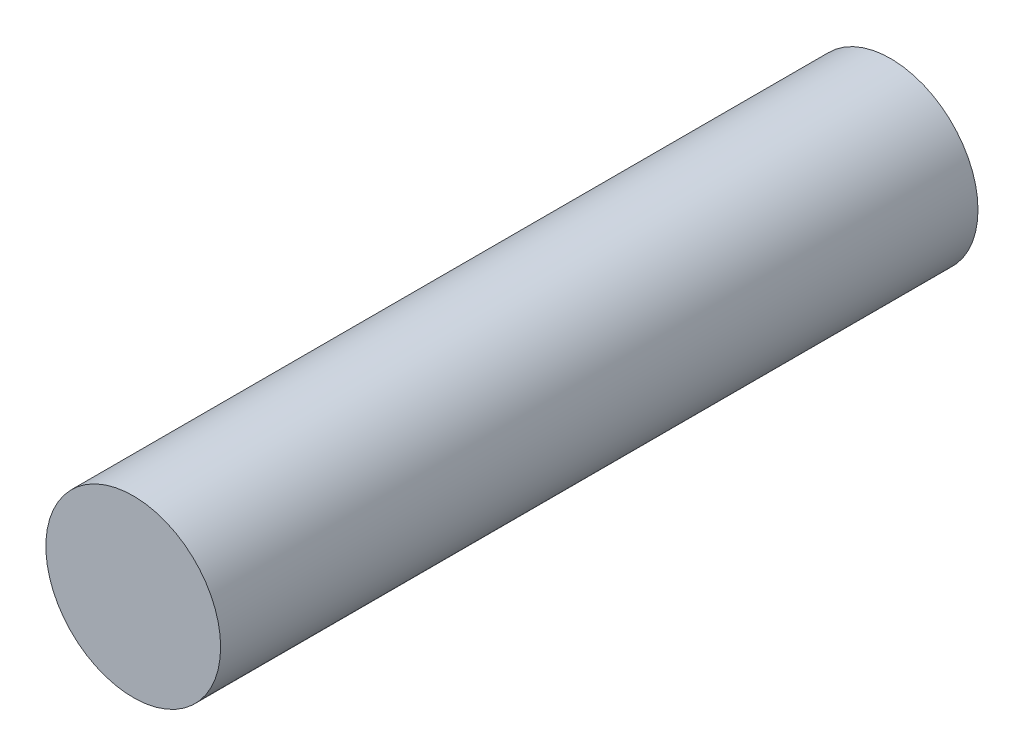
ISO-10303-21;
HEADER;
FILE_DESCRIPTION(('STEP AP214'),'2;1');
FILE_NAME('part.step','',(''),(''),'','','');
FILE_SCHEMA(('AUTOMOTIVE_DESIGN { 1 0 10303 214 1 1 1 1 }'));
ENDSEC;
DATA;
#1=APPLICATION_CONTEXT('core data for automotive mechanical design processes');
#2=APPLICATION_PROTOCOL_DEFINITION('international standard','automotive_design',2000,#1);
#3=PRODUCT_CONTEXT('',#1,'mechanical');
#4=PRODUCT('Part','Part','',(#3));
#5=PRODUCT_RELATED_PRODUCT_CATEGORY('part','',(#4));
#6=PRODUCT_DEFINITION_FORMATION('','',#4);
#7=PRODUCT_DEFINITION_CONTEXT('part definition',#1,'design');
#8=PRODUCT_DEFINITION('design','',#6,#7);
#9=PRODUCT_DEFINITION_SHAPE('','',#8);
#10=(LENGTH_UNIT() NAMED_UNIT(*) SI_UNIT(.MILLI.,.METRE.));
#11=(NAMED_UNIT(*) PLANE_ANGLE_UNIT() SI_UNIT($,.RADIAN.));
#12=(NAMED_UNIT(*) SI_UNIT($,.STERADIAN.) SOLID_ANGLE_UNIT());
#13=UNCERTAINTY_MEASURE_WITH_UNIT(LENGTH_MEASURE(1.E-05),#10,'distance_accuracy_value','');
#14=(GEOMETRIC_REPRESENTATION_CONTEXT(3) GLOBAL_UNCERTAINTY_ASSIGNED_CONTEXT((#13)) GLOBAL_UNIT_ASSIGNED_CONTEXT((#10,
#11,#12)) REPRESENTATION_CONTEXT('',''));
#15=CARTESIAN_POINT('',(0.,0.,0.));
#16=DIRECTION('',(0.,0.,1.));
#17=DIRECTION('',(1.,0.,0.));
#18=AXIS2_PLACEMENT_3D('',#15,#16,#17);
#19=CARTESIAN_POINT('',(0.,0.,26.));
#20=DIRECTION('',(0.,0.,-1.));
#21=DIRECTION('',(-1.,0.,0.));
#22=AXIS2_PLACEMENT_3D('',#19,#20,#21);
#23=CYLINDRICAL_SURFACE('',#22,3.);
#24=CARTESIAN_POINT('',(0.,0.,26.));
#25=DIRECTION('',(0.,0.,1.));
#26=DIRECTION('',(1.,0.,0.));
#27=AXIS2_PLACEMENT_3D('',#24,#25,#26);
#28=CIRCLE('',#27,3.);
#29=CARTESIAN_POINT('',(3.,0.,26.));
#30=VERTEX_POINT('',#29);
#31=EDGE_CURVE('E10',#30,#30,#28,.T.);
#32=ORIENTED_EDGE('',*,*,#31,.F.);
#33=EDGE_LOOP('',(#32));
#34=FACE_BOUND('',#33,.T.);
#35=CARTESIAN_POINT('',(0.,0.,0.));
#36=DIRECTION('',(0.,0.,1.));
#37=DIRECTION('',(1.,0.,0.));
#38=AXIS2_PLACEMENT_3D('',#35,#36,#37);
#39=CIRCLE('',#38,3.);
#40=CARTESIAN_POINT('',(3.,0.,0.));
#41=VERTEX_POINT('',#40);
#42=EDGE_CURVE('E46',#41,#41,#39,.T.);
#43=ORIENTED_EDGE('',*,*,#42,.T.);
#44=EDGE_LOOP('',(#43));
#45=FACE_BOUND('',#44,.T.);
#46=ADVANCED_FACE('F43',(#34,#45),#23,.T.);
#47=CARTESIAN_POINT('',(0.,0.,26.));
#48=DIRECTION('',(0.,0.,1.));
#49=DIRECTION('',(1.,0.,0.));
#50=AXIS2_PLACEMENT_3D('',#47,#48,#49);
#51=PLANE('',#50);
#52=ORIENTED_EDGE('',*,*,#31,.T.);
#53=EDGE_LOOP('',(#52));
#54=FACE_BOUND('',#53,.T.);
#55=ADVANCED_FACE('F58',(#54),#51,.T.);
#56=CARTESIAN_POINT('',(0.,0.,0.));
#57=DIRECTION('',(0.,0.,1.));
#58=DIRECTION('',(1.,0.,0.));
#59=AXIS2_PLACEMENT_3D('',#56,#57,#58);
#60=PLANE('',#59);
#61=ORIENTED_EDGE('',*,*,#42,.F.);
#62=EDGE_LOOP('',(#61));
#63=FACE_BOUND('',#62,.T.);
#64=ADVANCED_FACE('F56',(#63),#60,.F.);
#65=CLOSED_SHELL('',(#46,#55,#64));
#66=MANIFOLD_SOLID_BREP('B2',#65);
#67=ADVANCED_BREP_SHAPE_REPRESENTATION('',(#18,#66),#14);
#68=SHAPE_DEFINITION_REPRESENTATION(#9,#67);
ENDSEC;
END-ISO-10303-21;
